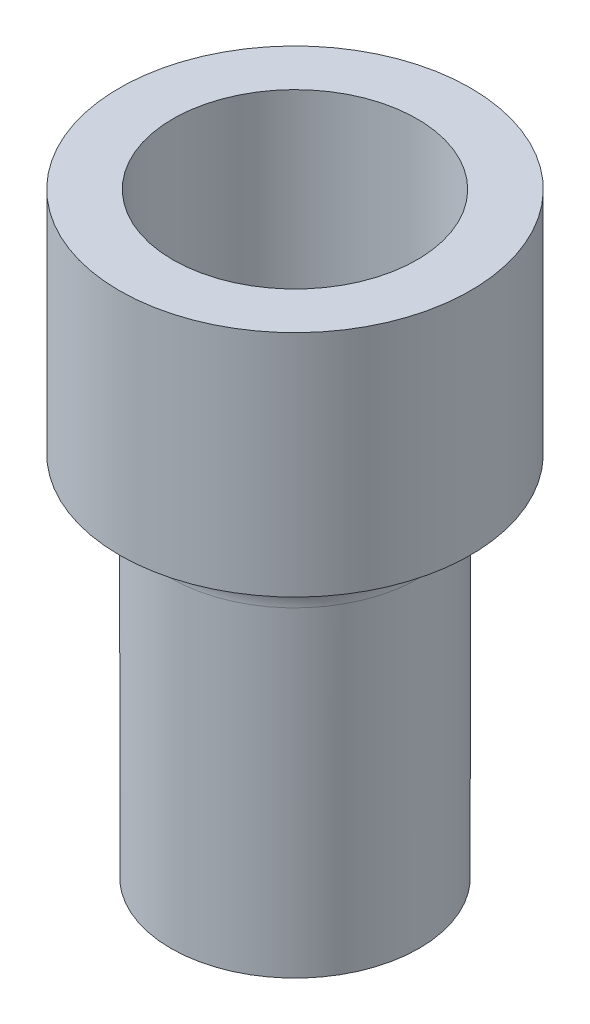
ISO-10303-21;
HEADER;
FILE_DESCRIPTION(('STEP AP214'),'2;1');
FILE_NAME('part.step','',(''),(''),'','','');
FILE_SCHEMA(('AUTOMOTIVE_DESIGN { 1 0 10303 214 1 1 1 1 }'));
ENDSEC;
DATA;
#1=APPLICATION_CONTEXT('core data for automotive mechanical design processes');
#2=APPLICATION_PROTOCOL_DEFINITION('international standard','automotive_design',2000,#1);
#3=PRODUCT_CONTEXT('',#1,'mechanical');
#4=PRODUCT('Part','Part','',(#3));
#5=PRODUCT_RELATED_PRODUCT_CATEGORY('part','',(#4));
#6=PRODUCT_DEFINITION_FORMATION('','',#4);
#7=PRODUCT_DEFINITION_CONTEXT('part definition',#1,'design');
#8=PRODUCT_DEFINITION('design','',#6,#7);
#9=PRODUCT_DEFINITION_SHAPE('','',#8);
#10=(LENGTH_UNIT() NAMED_UNIT(*) SI_UNIT(.MILLI.,.METRE.));
#11=(NAMED_UNIT(*) PLANE_ANGLE_UNIT() SI_UNIT($,.RADIAN.));
#12=(NAMED_UNIT(*) SI_UNIT($,.STERADIAN.) SOLID_ANGLE_UNIT());
#13=UNCERTAINTY_MEASURE_WITH_UNIT(LENGTH_MEASURE(1.E-05),#10,'distance_accuracy_value','');
#14=(GEOMETRIC_REPRESENTATION_CONTEXT(3) GLOBAL_UNCERTAINTY_ASSIGNED_CONTEXT((#13)) GLOBAL_UNIT_ASSIGNED_CONTEXT((#10,
#11,#12)) REPRESENTATION_CONTEXT('',''));
#15=CARTESIAN_POINT('',(0.,0.,0.));
#16=DIRECTION('',(0.,0.,1.));
#17=DIRECTION('',(1.,0.,0.));
#18=AXIS2_PLACEMENT_3D('',#15,#16,#17);
#19=CARTESIAN_POINT('',(0.,7.62,0.));
#20=DIRECTION('',(0.,1.,0.));
#21=DIRECTION('',(0.,0.,1.));
#22=AXIS2_PLACEMENT_3D('',#19,#20,#21);
#23=PLANE('',#22);
#24=CARTESIAN_POINT('',(0.,7.62,0.));
#25=DIRECTION('',(0.,1.,0.));
#26=DIRECTION('',(0.,0.,1.));
#27=AXIS2_PLACEMENT_3D('',#24,#25,#26);
#28=CIRCLE('',#27,5.842);
#29=CARTESIAN_POINT('',(0.,7.62,5.842));
#30=VERTEX_POINT('',#29);
#31=EDGE_CURVE('E50',#30,#30,#28,.T.);
#32=ORIENTED_EDGE('',*,*,#31,.T.);
#33=EDGE_LOOP('',(#32));
#34=FACE_BOUND('',#33,.T.);
#35=CARTESIAN_POINT('',(0.,7.62,0.));
#36=DIRECTION('',(0.,1.,0.));
#37=DIRECTION('',(0.,0.,1.));
#38=AXIS2_PLACEMENT_3D('',#35,#36,#37);
#39=CIRCLE('',#38,4.064);
#40=CARTESIAN_POINT('',(0.,7.62,4.064));
#41=VERTEX_POINT('',#40);
#42=EDGE_CURVE('E60',#41,#41,#39,.T.);
#43=ORIENTED_EDGE('',*,*,#42,.F.);
#44=EDGE_LOOP('',(#43));
#45=FACE_BOUND('',#44,.T.);
#46=ADVANCED_FACE('F37',(#34,#45),#23,.T.);
#47=CARTESIAN_POINT('',(0.,0.,0.));
#48=DIRECTION('',(0.,1.,0.));
#49=DIRECTION('',(0.,0.,1.));
#50=AXIS2_PLACEMENT_3D('',#47,#48,#49);
#51=PLANE('',#50);
#52=CARTESIAN_POINT('',(0.,0.,0.));
#53=DIRECTION('',(0.,1.,0.));
#54=DIRECTION('',(0.,0.,1.));
#55=AXIS2_PLACEMENT_3D('',#52,#53,#54);
#56=CIRCLE('',#55,5.6515);
#57=CARTESIAN_POINT('',(0.,0.,5.6515));
#58=VERTEX_POINT('',#57);
#59=EDGE_CURVE('E10',#58,#58,#56,.T.);
#60=ORIENTED_EDGE('',*,*,#59,.T.);
#61=EDGE_LOOP('',(#60));
#62=FACE_BOUND('',#61,.T.);
#63=CARTESIAN_POINT('',(0.,0.,0.));
#64=DIRECTION('',(0.,1.,0.));
#65=DIRECTION('',(0.,0.,1.));
#66=AXIS2_PLACEMENT_3D('',#63,#64,#65);
#67=CIRCLE('',#66,5.842);
#68=CARTESIAN_POINT('',(0.,0.,5.842));
#69=VERTEX_POINT('',#68);
#70=EDGE_CURVE('E55',#69,#69,#67,.T.);
#71=ORIENTED_EDGE('',*,*,#70,.F.);
#72=EDGE_LOOP('',(#71));
#73=FACE_BOUND('',#72,.T.);
#74=ADVANCED_FACE('F90',(#62,#73),#51,.F.);
#75=CARTESIAN_POINT('',(0.,7.62,0.));
#76=DIRECTION('',(0.,-1.,0.));
#77=DIRECTION('',(0.,0.,-1.));
#78=AXIS2_PLACEMENT_3D('',#75,#76,#77);
#79=CYLINDRICAL_SURFACE('',#78,5.842);
#80=ORIENTED_EDGE('',*,*,#31,.F.);
#81=EDGE_LOOP('',(#80));
#82=FACE_BOUND('',#81,.T.);
#83=ORIENTED_EDGE('',*,*,#70,.T.);
#84=EDGE_LOOP('',(#83));
#85=FACE_BOUND('',#84,.T.);
#86=ADVANCED_FACE('F96',(#82,#85),#79,.T.);
#87=CARTESIAN_POINT('',(0.,7.62,0.));
#88=DIRECTION('',(0.,-1.,0.));
#89=DIRECTION('',(0.,0.,-1.));
#90=AXIS2_PLACEMENT_3D('',#87,#88,#89);
#91=CYLINDRICAL_SURFACE('',#90,4.064);
#92=ORIENTED_EDGE('',*,*,#42,.T.);
#93=EDGE_LOOP('',(#92));
#94=FACE_BOUND('',#93,.T.);
#95=CARTESIAN_POINT('',(0.,0.,0.));
#96=DIRECTION('',(0.,1.,0.));
#97=DIRECTION('',(0.,0.,1.));
#98=AXIS2_PLACEMENT_3D('',#95,#96,#97);
#99=CIRCLE('',#98,4.064);
#100=CARTESIAN_POINT('',(0.,0.,4.064));
#101=VERTEX_POINT('',#100);
#102=EDGE_CURVE('E62',#101,#101,#99,.T.);
#103=ORIENTED_EDGE('',*,*,#102,.F.);
#104=EDGE_LOOP('',(#103));
#105=FACE_BOUND('',#104,.T.);
#106=ADVANCED_FACE('F85',(#94,#105),#91,.F.);
#107=CARTESIAN_POINT('',(0.,0.,0.));
#108=DIRECTION('',(0.,-1.,0.));
#109=DIRECTION('',(0.,0.,-1.));
#110=AXIS2_PLACEMENT_3D('',#107,#108,#109);
#111=PLANE('',#110);
#112=ORIENTED_EDGE('',*,*,#102,.T.);
#113=EDGE_LOOP('',(#112));
#114=FACE_BOUND('',#113,.T.);
#115=ADVANCED_FACE('F78',(#114),#111,.F.);
#116=CARTESIAN_POINT('',(0.,-12.192,0.));
#117=DIRECTION('',(0.,1.,0.));
#118=DIRECTION('',(0.,0.,1.));
#119=AXIS2_PLACEMENT_3D('',#116,#117,#118);
#120=CYLINDRICAL_SURFACE('',#119,4.1275);
#121=CARTESIAN_POINT('',(0.,-1.524,0.));
#122=DIRECTION('',(0.,1.,0.));
#123=DIRECTION('',(0.,0.,1.));
#124=AXIS2_PLACEMENT_3D('',#121,#122,#123);
#125=CIRCLE('',#124,4.1275);
#126=CARTESIAN_POINT('',(0.,-1.524,4.1275));
#127=VERTEX_POINT('',#126);
#128=EDGE_CURVE('E45',#127,#127,#125,.F.);
#129=ORIENTED_EDGE('',*,*,#128,.T.);
#130=EDGE_LOOP('',(#129));
#131=FACE_BOUND('',#130,.T.);
#132=CARTESIAN_POINT('',(0.,-12.192,0.));
#133=DIRECTION('',(0.,-1.,0.));
#134=DIRECTION('',(0.,0.,-1.));
#135=AXIS2_PLACEMENT_3D('',#132,#133,#134);
#136=CIRCLE('',#135,4.1275);
#137=CARTESIAN_POINT('',(0.,-12.192,-4.1275));
#138=VERTEX_POINT('',#137);
#139=EDGE_CURVE('E66',#138,#138,#136,.T.);
#140=ORIENTED_EDGE('',*,*,#139,.F.);
#141=EDGE_LOOP('',(#140));
#142=FACE_BOUND('',#141,.T.);
#143=ADVANCED_FACE('F76',(#131,#142),#120,.T.);
#144=CARTESIAN_POINT('',(0.,-12.192,0.));
#145=DIRECTION('',(0.,-1.,0.));
#146=DIRECTION('',(0.,0.,-1.));
#147=AXIS2_PLACEMENT_3D('',#144,#145,#146);
#148=PLANE('',#147);
#149=ORIENTED_EDGE('',*,*,#139,.T.);
#150=EDGE_LOOP('',(#149));
#151=FACE_BOUND('',#150,.T.);
#152=ADVANCED_FACE('F74',(#151),#148,.T.);
#153=CARTESIAN_POINT('',(0.,-1.524,0.));
#154=DIRECTION('',(0.,1.,0.));
#155=DIRECTION('',(0.,0.,1.));
#156=AXIS2_PLACEMENT_3D('',#153,#154,#155);
#157=TOROIDAL_SURFACE('',#156,5.6515,1.524);
#158=ORIENTED_EDGE('',*,*,#59,.F.);
#159=EDGE_LOOP('',(#158));
#160=FACE_BOUND('',#159,.T.);
#161=ORIENTED_EDGE('',*,*,#128,.F.);
#162=EDGE_LOOP('',(#161));
#163=FACE_BOUND('',#162,.T.);
#164=ADVANCED_FACE('F39',(#160,#163),#157,.F.);
#165=CLOSED_SHELL('',(#46,#74,#86,#106,#115,#143,#152,#164));
#166=MANIFOLD_SOLID_BREP('B2',#165);
#167=ADVANCED_BREP_SHAPE_REPRESENTATION('',(#18,#166),#14);
#168=SHAPE_DEFINITION_REPRESENTATION(#9,#167);
ENDSEC;
END-ISO-10303-21;
